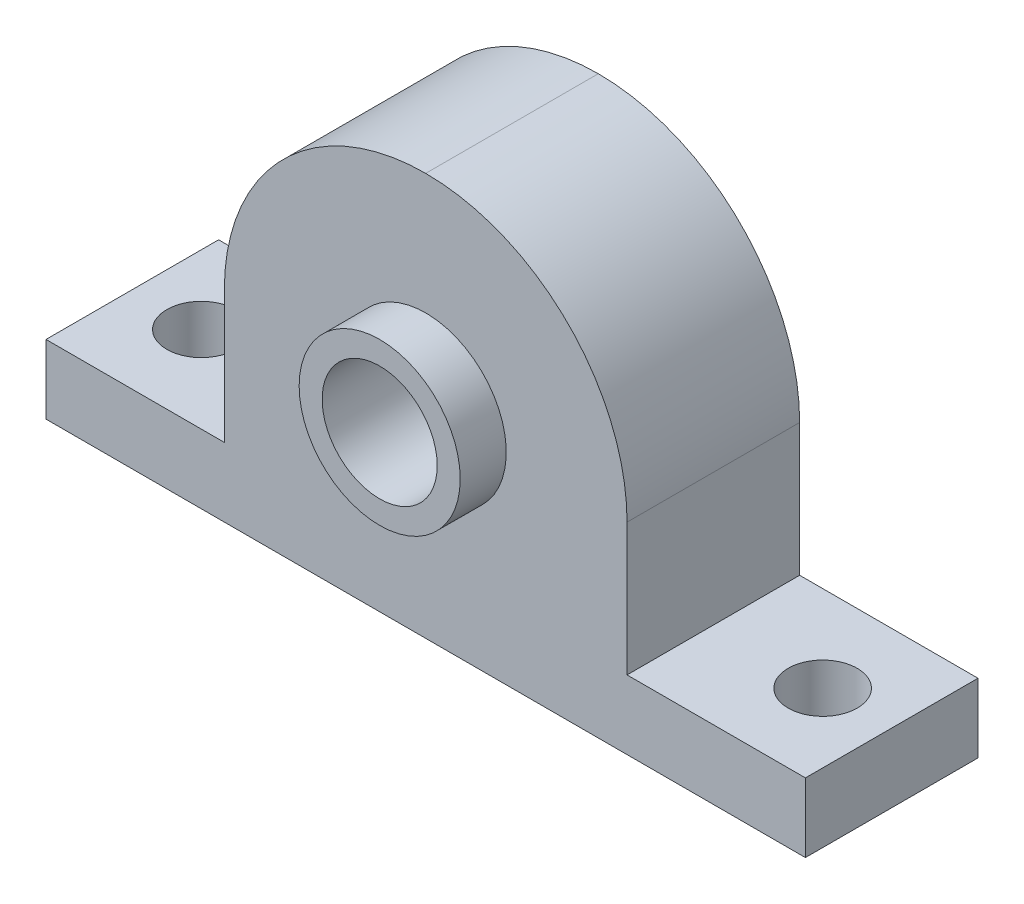
ISO-10303-21;
HEADER;
FILE_DESCRIPTION(('STEP AP214'),'2;1');
FILE_NAME('part.step','',(''),(''),'','','');
FILE_SCHEMA(('AUTOMOTIVE_DESIGN { 1 0 10303 214 1 1 1 1 }'));
ENDSEC;
DATA;
#1=APPLICATION_CONTEXT('core data for automotive mechanical design processes');
#2=APPLICATION_PROTOCOL_DEFINITION('international standard','automotive_design',2000,#1);
#3=PRODUCT_CONTEXT('',#1,'mechanical');
#4=PRODUCT('Part','Part','',(#3));
#5=PRODUCT_RELATED_PRODUCT_CATEGORY('part','',(#4));
#6=PRODUCT_DEFINITION_FORMATION('','',#4);
#7=PRODUCT_DEFINITION_CONTEXT('part definition',#1,'design');
#8=PRODUCT_DEFINITION('design','',#6,#7);
#9=PRODUCT_DEFINITION_SHAPE('','',#8);
#10=(LENGTH_UNIT() NAMED_UNIT(*) SI_UNIT(.MILLI.,.METRE.));
#11=(NAMED_UNIT(*) PLANE_ANGLE_UNIT() SI_UNIT($,.RADIAN.));
#12=(NAMED_UNIT(*) SI_UNIT($,.STERADIAN.) SOLID_ANGLE_UNIT());
#13=UNCERTAINTY_MEASURE_WITH_UNIT(LENGTH_MEASURE(1.E-05),#10,'distance_accuracy_value','');
#14=(GEOMETRIC_REPRESENTATION_CONTEXT(3) GLOBAL_UNCERTAINTY_ASSIGNED_CONTEXT((#13)) GLOBAL_UNIT_ASSIGNED_CONTEXT((#10,
#11,#12)) REPRESENTATION_CONTEXT('',''));
#15=CARTESIAN_POINT('',(0.,0.,0.));
#16=DIRECTION('',(0.,0.,1.));
#17=DIRECTION('',(1.,0.,0.));
#18=AXIS2_PLACEMENT_3D('',#15,#16,#17);
#19=CARTESIAN_POINT('',(0.,6.,0.));
#20=DIRECTION('',(0.,-1.,0.));
#21=DIRECTION('',(0.,0.,-1.));
#22=AXIS2_PLACEMENT_3D('',#19,#20,#21);
#23=PLANE('',#22);
#24=CARTESIAN_POINT('',(27.,6.,0.));
#25=DIRECTION('',(0.,-1.,0.));
#26=DIRECTION('',(0.,0.,1.));
#27=AXIS2_PLACEMENT_3D('',#24,#25,#26);
#28=CIRCLE('',#27,3.);
#29=CARTESIAN_POINT('',(27.,6.,3.));
#30=VERTEX_POINT('',#29);
#31=EDGE_CURVE('E218',#30,#30,#28,.T.);
#32=ORIENTED_EDGE('',*,*,#31,.T.);
#33=EDGE_LOOP('',(#32));
#34=FACE_BOUND('',#33,.T.);
#35=DIRECTION('',(0.,0.,-1.));
#36=VECTOR('',#35,1.);
#37=CARTESIAN_POINT('',(17.5,6.,7.5));
#38=LINE('',#37,#36);
#39=CARTESIAN_POINT('',(17.5,6.,7.5));
#40=VERTEX_POINT('',#39);
#41=CARTESIAN_POINT('',(17.5,6.,-7.5));
#42=VERTEX_POINT('',#41);
#43=EDGE_CURVE('E124',#40,#42,#38,.T.);
#44=ORIENTED_EDGE('',*,*,#43,.F.);
#45=DIRECTION('',(1.,0.,0.));
#46=VECTOR('',#45,1.);
#47=CARTESIAN_POINT('',(-33.,6.,7.5));
#48=LINE('',#47,#46);
#49=CARTESIAN_POINT('',(33.,6.,7.5));
#50=VERTEX_POINT('',#49);
#51=EDGE_CURVE('E120',#40,#50,#48,.T.);
#52=ORIENTED_EDGE('',*,*,#51,.T.);
#53=DIRECTION('',(0.,0.,-1.));
#54=VECTOR('',#53,1.);
#55=CARTESIAN_POINT('',(33.,6.,7.5));
#56=LINE('',#55,#54);
#57=CARTESIAN_POINT('',(33.,6.,-7.5));
#58=VERTEX_POINT('',#57);
#59=EDGE_CURVE('E141',#50,#58,#56,.T.);
#60=ORIENTED_EDGE('',*,*,#59,.T.);
#61=DIRECTION('',(-1.,0.,0.));
#62=VECTOR('',#61,1.);
#63=CARTESIAN_POINT('',(-33.,6.,-7.5));
#64=LINE('',#63,#62);
#65=EDGE_CURVE('E151',#58,#42,#64,.T.);
#66=ORIENTED_EDGE('',*,*,#65,.T.);
#67=EDGE_LOOP('',(#44,#52,#60,#66));
#68=FACE_BOUND('',#67,.T.);
#69=ADVANCED_FACE('F33',(#34,#68),#23,.F.);
#70=CARTESIAN_POINT('',(-27.,6.,0.));
#71=DIRECTION('',(0.,1.,0.));
#72=DIRECTION('',(0.,0.,1.));
#73=AXIS2_PLACEMENT_3D('',#70,#71,#72);
#74=CIRCLE('',#73,3.);
#75=CARTESIAN_POINT('',(-27.,6.,3.));
#76=VERTEX_POINT('',#75);
#77=EDGE_CURVE('E212',#76,#76,#74,.T.);
#78=ORIENTED_EDGE('',*,*,#77,.F.);
#79=EDGE_LOOP('',(#78));
#80=FACE_BOUND('',#79,.T.);
#81=DIRECTION('',(0.,0.,1.));
#82=VECTOR('',#81,1.);
#83=CARTESIAN_POINT('',(-17.5,6.,7.5));
#84=LINE('',#83,#82);
#85=CARTESIAN_POINT('',(-17.5,6.,-7.5));
#86=VERTEX_POINT('',#85);
#87=CARTESIAN_POINT('',(-17.5,6.,7.5));
#88=VERTEX_POINT('',#87);
#89=EDGE_CURVE('E114',#86,#88,#84,.T.);
#90=ORIENTED_EDGE('',*,*,#89,.F.);
#91=CARTESIAN_POINT('',(-33.,6.,-7.5));
#92=VERTEX_POINT('',#91);
#93=EDGE_CURVE('E144',#86,#92,#64,.T.);
#94=ORIENTED_EDGE('',*,*,#93,.T.);
#95=DIRECTION('',(0.,0.,1.));
#96=VECTOR('',#95,1.);
#97=CARTESIAN_POINT('',(-33.,6.,7.5));
#98=LINE('',#97,#96);
#99=CARTESIAN_POINT('',(-33.,6.,7.5));
#100=VERTEX_POINT('',#99);
#101=EDGE_CURVE('E117',#92,#100,#98,.T.);
#102=ORIENTED_EDGE('',*,*,#101,.T.);
#103=EDGE_CURVE('E104',#100,#88,#48,.T.);
#104=ORIENTED_EDGE('',*,*,#103,.T.);
#105=EDGE_LOOP('',(#90,#94,#102,#104));
#106=FACE_BOUND('',#105,.T.);
#107=ADVANCED_FACE('F113',(#80,#106),#23,.F.);
#108=CARTESIAN_POINT('',(33.,6.,7.5));
#109=DIRECTION('',(-1.,0.,0.));
#110=DIRECTION('',(0.,0.,1.));
#111=AXIS2_PLACEMENT_3D('',#108,#109,#110);
#112=PLANE('',#111);
#113=DIRECTION('',(0.,0.,-1.));
#114=VECTOR('',#113,1.);
#115=CARTESIAN_POINT('',(33.,0.,7.5));
#116=LINE('',#115,#114);
#117=CARTESIAN_POINT('',(33.,0.,7.5));
#118=VERTEX_POINT('',#117);
#119=CARTESIAN_POINT('',(33.,0.,-7.5));
#120=VERTEX_POINT('',#119);
#121=EDGE_CURVE('E170',#118,#120,#116,.T.);
#122=ORIENTED_EDGE('',*,*,#121,.T.);
#123=DIRECTION('',(0.,-1.,0.));
#124=VECTOR('',#123,1.);
#125=CARTESIAN_POINT('',(33.,6.,-7.5));
#126=LINE('',#125,#124);
#127=EDGE_CURVE('E154',#58,#120,#126,.T.);
#128=ORIENTED_EDGE('',*,*,#127,.F.);
#129=ORIENTED_EDGE('',*,*,#59,.F.);
#130=DIRECTION('',(0.,-1.,0.));
#131=VECTOR('',#130,1.);
#132=CARTESIAN_POINT('',(33.,6.,7.5));
#133=LINE('',#132,#131);
#134=EDGE_CURVE('E119',#50,#118,#133,.T.);
#135=ORIENTED_EDGE('',*,*,#134,.T.);
#136=EDGE_LOOP('',(#122,#128,#129,#135));
#137=FACE_BOUND('',#136,.T.);
#138=ADVANCED_FACE('F239',(#137),#112,.F.);
#139=CARTESIAN_POINT('',(-33.,6.,-7.5));
#140=DIRECTION('',(0.,0.,1.));
#141=DIRECTION('',(1.,0.,0.));
#142=AXIS2_PLACEMENT_3D('',#139,#140,#141);
#143=PLANE('',#142);
#144=CARTESIAN_POINT('',(0.,17.5,-7.5));
#145=DIRECTION('',(0.,0.,1.));
#146=DIRECTION('',(1.,0.,0.));
#147=AXIS2_PLACEMENT_3D('',#144,#145,#146);
#148=CIRCLE('',#147,5.);
#149=CARTESIAN_POINT('',(5.,17.5,-7.5));
#150=VERTEX_POINT('',#149);
#151=EDGE_CURVE('E202',#150,#150,#148,.T.);
#152=ORIENTED_EDGE('',*,*,#151,.T.);
#153=EDGE_LOOP('',(#152));
#154=FACE_BOUND('',#153,.T.);
#155=CARTESIAN_POINT('',(0.,17.5,-7.5));
#156=DIRECTION('',(0.,0.,1.));
#157=DIRECTION('',(1.,0.,0.));
#158=AXIS2_PLACEMENT_3D('',#155,#156,#157);
#159=CIRCLE('',#158,17.5);
#160=CARTESIAN_POINT('',(-17.5,17.5,-7.5));
#161=VERTEX_POINT('',#160);
#162=CARTESIAN_POINT('',(0.,35.,-7.5));
#163=VERTEX_POINT('',#162);
#164=EDGE_CURVE('E157',#161,#163,#159,.F.);
#165=ORIENTED_EDGE('',*,*,#164,.T.);
#166=CARTESIAN_POINT('',(0.,17.5,-7.5));
#167=DIRECTION('',(0.,0.,1.));
#168=DIRECTION('',(1.,0.,0.));
#169=AXIS2_PLACEMENT_3D('',#166,#167,#168);
#170=CIRCLE('',#169,17.5);
#171=CARTESIAN_POINT('',(17.5,17.5,-7.5));
#172=VERTEX_POINT('',#171);
#173=EDGE_CURVE('E190',#163,#172,#170,.F.);
#174=ORIENTED_EDGE('',*,*,#173,.T.);
#175=DIRECTION('',(0.,-1.,0.));
#176=VECTOR('',#175,1.);
#177=CARTESIAN_POINT('',(17.5,35.,-7.5));
#178=LINE('',#177,#176);
#179=EDGE_CURVE('E172',#172,#42,#178,.T.);
#180=ORIENTED_EDGE('',*,*,#179,.T.);
#181=ORIENTED_EDGE('',*,*,#65,.F.);
#182=ORIENTED_EDGE('',*,*,#127,.T.);
#183=DIRECTION('',(-1.,0.,0.));
#184=VECTOR('',#183,1.);
#185=CARTESIAN_POINT('',(-33.,0.,-7.5));
#186=LINE('',#185,#184);
#187=CARTESIAN_POINT('',(-33.,0.,-7.5));
#188=VERTEX_POINT('',#187);
#189=EDGE_CURVE('E168',#120,#188,#186,.T.);
#190=ORIENTED_EDGE('',*,*,#189,.T.);
#191=DIRECTION('',(0.,-1.,0.));
#192=VECTOR('',#191,1.);
#193=CARTESIAN_POINT('',(-33.,6.,-7.5));
#194=LINE('',#193,#192);
#195=EDGE_CURVE('E158',#92,#188,#194,.T.);
#196=ORIENTED_EDGE('',*,*,#195,.F.);
#197=ORIENTED_EDGE('',*,*,#93,.F.);
#198=DIRECTION('',(0.,-1.,0.));
#199=VECTOR('',#198,1.);
#200=CARTESIAN_POINT('',(-17.5,35.,-7.5));
#201=LINE('',#200,#199);
#202=EDGE_CURVE('E108',#161,#86,#201,.T.);
#203=ORIENTED_EDGE('',*,*,#202,.F.);
#204=EDGE_LOOP('',(#165,#174,#180,#181,#182,#190,#196,#197,#203));
#205=FACE_BOUND('',#204,.T.);
#206=ADVANCED_FACE('F237',(#154,#205),#143,.F.);
#207=CARTESIAN_POINT('',(-33.,6.,7.5));
#208=DIRECTION('',(1.,0.,0.));
#209=DIRECTION('',(0.,0.,-1.));
#210=AXIS2_PLACEMENT_3D('',#207,#208,#209);
#211=PLANE('',#210);
#212=DIRECTION('',(0.,0.,1.));
#213=VECTOR('',#212,1.);
#214=CARTESIAN_POINT('',(-33.,0.,7.5));
#215=LINE('',#214,#213);
#216=CARTESIAN_POINT('',(-33.,0.,7.5));
#217=VERTEX_POINT('',#216);
#218=EDGE_CURVE('E166',#188,#217,#215,.T.);
#219=ORIENTED_EDGE('',*,*,#218,.T.);
#220=DIRECTION('',(0.,-1.,0.));
#221=VECTOR('',#220,1.);
#222=CARTESIAN_POINT('',(-33.,6.,7.5));
#223=LINE('',#222,#221);
#224=EDGE_CURVE('E161',#100,#217,#223,.T.);
#225=ORIENTED_EDGE('',*,*,#224,.F.);
#226=ORIENTED_EDGE('',*,*,#101,.F.);
#227=ORIENTED_EDGE('',*,*,#195,.T.);
#228=EDGE_LOOP('',(#219,#225,#226,#227));
#229=FACE_BOUND('',#228,.T.);
#230=ADVANCED_FACE('F245',(#229),#211,.F.);
#231=CARTESIAN_POINT('',(-33.,6.,7.5));
#232=DIRECTION('',(0.,0.,-1.));
#233=DIRECTION('',(-1.,0.,0.));
#234=AXIS2_PLACEMENT_3D('',#231,#232,#233);
#235=PLANE('',#234);
#236=CARTESIAN_POINT('',(0.,17.5,7.5));
#237=DIRECTION('',(0.,0.,-1.));
#238=DIRECTION('',(-1.,0.,0.));
#239=AXIS2_PLACEMENT_3D('',#236,#237,#238);
#240=CIRCLE('',#239,7.);
#241=CARTESIAN_POINT('',(-7.,17.5,7.5));
#242=VERTEX_POINT('',#241);
#243=EDGE_CURVE('E11',#242,#242,#240,.F.);
#244=ORIENTED_EDGE('',*,*,#243,.F.);
#245=EDGE_LOOP('',(#244));
#246=FACE_BOUND('',#245,.T.);
#247=DIRECTION('',(0.,-1.,0.));
#248=VECTOR('',#247,1.);
#249=CARTESIAN_POINT('',(17.5,35.,7.5));
#250=LINE('',#249,#248);
#251=CARTESIAN_POINT('',(17.5,17.5,7.5));
#252=VERTEX_POINT('',#251);
#253=EDGE_CURVE('E109',#252,#40,#250,.T.);
#254=ORIENTED_EDGE('',*,*,#253,.F.);
#255=CARTESIAN_POINT('',(0.,17.5,7.5));
#256=DIRECTION('',(0.,0.,-1.));
#257=DIRECTION('',(-1.,0.,0.));
#258=AXIS2_PLACEMENT_3D('',#255,#256,#257);
#259=CIRCLE('',#258,17.5);
#260=CARTESIAN_POINT('',(0.,35.,7.5));
#261=VERTEX_POINT('',#260);
#262=EDGE_CURVE('E53',#252,#261,#259,.F.);
#263=ORIENTED_EDGE('',*,*,#262,.T.);
#264=CARTESIAN_POINT('',(0.,17.5,7.5));
#265=DIRECTION('',(0.,0.,-1.));
#266=DIRECTION('',(-1.,0.,0.));
#267=AXIS2_PLACEMENT_3D('',#264,#265,#266);
#268=CIRCLE('',#267,17.5);
#269=CARTESIAN_POINT('',(-17.5,17.5,7.5));
#270=VERTEX_POINT('',#269);
#271=EDGE_CURVE('E48',#261,#270,#268,.F.);
#272=ORIENTED_EDGE('',*,*,#271,.T.);
#273=DIRECTION('',(0.,-1.,0.));
#274=VECTOR('',#273,1.);
#275=CARTESIAN_POINT('',(-17.5,35.,7.5));
#276=LINE('',#275,#274);
#277=EDGE_CURVE('E100',#270,#88,#276,.T.);
#278=ORIENTED_EDGE('',*,*,#277,.T.);
#279=ORIENTED_EDGE('',*,*,#103,.F.);
#280=ORIENTED_EDGE('',*,*,#224,.T.);
#281=DIRECTION('',(1.,0.,0.));
#282=VECTOR('',#281,1.);
#283=CARTESIAN_POINT('',(-33.,0.,7.5));
#284=LINE('',#283,#282);
#285=EDGE_CURVE('E145',#217,#118,#284,.T.);
#286=ORIENTED_EDGE('',*,*,#285,.T.);
#287=ORIENTED_EDGE('',*,*,#134,.F.);
#288=ORIENTED_EDGE('',*,*,#51,.F.);
#289=EDGE_LOOP('',(#254,#263,#272,#278,#279,#280,#286,#287,#288));
#290=FACE_BOUND('',#289,.T.);
#291=ADVANCED_FACE('F102',(#246,#290),#235,.F.);
#292=CARTESIAN_POINT('',(0.,0.,0.));
#293=DIRECTION('',(0.,-1.,0.));
#294=DIRECTION('',(0.,0.,-1.));
#295=AXIS2_PLACEMENT_3D('',#292,#293,#294);
#296=PLANE('',#295);
#297=CARTESIAN_POINT('',(27.,0.,0.));
#298=DIRECTION('',(0.,-1.,0.));
#299=DIRECTION('',(0.,0.,1.));
#300=AXIS2_PLACEMENT_3D('',#297,#298,#299);
#301=CIRCLE('',#300,3.);
#302=CARTESIAN_POINT('',(27.,0.,3.));
#303=VERTEX_POINT('',#302);
#304=EDGE_CURVE('E215',#303,#303,#301,.T.);
#305=ORIENTED_EDGE('',*,*,#304,.F.);
#306=EDGE_LOOP('',(#305));
#307=FACE_BOUND('',#306,.T.);
#308=CARTESIAN_POINT('',(-27.,0.,0.));
#309=DIRECTION('',(0.,1.,0.));
#310=DIRECTION('',(0.,0.,1.));
#311=AXIS2_PLACEMENT_3D('',#308,#309,#310);
#312=CIRCLE('',#311,3.);
#313=CARTESIAN_POINT('',(-27.,0.,3.));
#314=VERTEX_POINT('',#313);
#315=EDGE_CURVE('E211',#314,#314,#312,.T.);
#316=ORIENTED_EDGE('',*,*,#315,.T.);
#317=EDGE_LOOP('',(#316));
#318=FACE_BOUND('',#317,.T.);
#319=ORIENTED_EDGE('',*,*,#121,.F.);
#320=ORIENTED_EDGE('',*,*,#285,.F.);
#321=ORIENTED_EDGE('',*,*,#218,.F.);
#322=ORIENTED_EDGE('',*,*,#189,.F.);
#323=EDGE_LOOP('',(#319,#320,#321,#322));
#324=FACE_BOUND('',#323,.T.);
#325=ADVANCED_FACE('F227',(#307,#318,#324),#296,.T.);
#326=CARTESIAN_POINT('',(17.5,35.,7.5));
#327=DIRECTION('',(-1.,0.,0.));
#328=DIRECTION('',(0.,0.,1.));
#329=AXIS2_PLACEMENT_3D('',#326,#327,#328);
#330=PLANE('',#329);
#331=ORIENTED_EDGE('',*,*,#179,.F.);
#332=DIRECTION('',(0.,0.,-1.));
#333=VECTOR('',#332,1.);
#334=CARTESIAN_POINT('',(17.5,17.5,7.5));
#335=LINE('',#334,#333);
#336=EDGE_CURVE('E191',#172,#252,#335,.F.);
#337=ORIENTED_EDGE('',*,*,#336,.T.);
#338=ORIENTED_EDGE('',*,*,#253,.T.);
#339=ORIENTED_EDGE('',*,*,#43,.T.);
#340=EDGE_LOOP('',(#331,#337,#338,#339));
#341=FACE_BOUND('',#340,.T.);
#342=ADVANCED_FACE('F230',(#341),#330,.F.);
#343=CARTESIAN_POINT('',(-17.5,35.,7.5));
#344=DIRECTION('',(1.,0.,0.));
#345=DIRECTION('',(0.,0.,-1.));
#346=AXIS2_PLACEMENT_3D('',#343,#344,#345);
#347=PLANE('',#346);
#348=ORIENTED_EDGE('',*,*,#277,.F.);
#349=DIRECTION('',(0.,0.,1.));
#350=VECTOR('',#349,1.);
#351=CARTESIAN_POINT('',(-17.5,17.5,7.5));
#352=LINE('',#351,#350);
#353=EDGE_CURVE('E41',#270,#161,#352,.F.);
#354=ORIENTED_EDGE('',*,*,#353,.T.);
#355=ORIENTED_EDGE('',*,*,#202,.T.);
#356=ORIENTED_EDGE('',*,*,#89,.T.);
#357=EDGE_LOOP('',(#348,#354,#355,#356));
#358=FACE_BOUND('',#357,.T.);
#359=ADVANCED_FACE('F122',(#358),#347,.F.);
#360=CARTESIAN_POINT('',(0.,17.5,0.));
#361=DIRECTION('',(0.,0.,1.));
#362=DIRECTION('',(1.,0.,0.));
#363=AXIS2_PLACEMENT_3D('',#360,#361,#362);
#364=CYLINDRICAL_SURFACE('',#363,17.5);
#365=ORIENTED_EDGE('',*,*,#353,.F.);
#366=ORIENTED_EDGE('',*,*,#271,.F.);
#367=DIRECTION('',(0.,0.,1.));
#368=VECTOR('',#367,1.);
#369=CARTESIAN_POINT('',(0.,35.,0.));
#370=LINE('',#369,#368);
#371=EDGE_CURVE('E128',#163,#261,#370,.T.);
#372=ORIENTED_EDGE('',*,*,#371,.F.);
#373=ORIENTED_EDGE('',*,*,#164,.F.);
#374=EDGE_LOOP('',(#365,#366,#372,#373));
#375=FACE_BOUND('',#374,.T.);
#376=ADVANCED_FACE('F35',(#375),#364,.T.);
#377=CARTESIAN_POINT('',(0.,17.5,0.));
#378=DIRECTION('',(0.,0.,-1.));
#379=DIRECTION('',(-1.,0.,0.));
#380=AXIS2_PLACEMENT_3D('',#377,#378,#379);
#381=CYLINDRICAL_SURFACE('',#380,17.5);
#382=ORIENTED_EDGE('',*,*,#262,.F.);
#383=ORIENTED_EDGE('',*,*,#336,.F.);
#384=ORIENTED_EDGE('',*,*,#173,.F.);
#385=ORIENTED_EDGE('',*,*,#371,.T.);
#386=EDGE_LOOP('',(#382,#383,#384,#385));
#387=FACE_BOUND('',#386,.T.);
#388=ADVANCED_FACE('F250',(#387),#381,.T.);
#389=CARTESIAN_POINT('',(0.,17.5,11.5));
#390=DIRECTION('',(0.,0.,-1.));
#391=DIRECTION('',(-1.,0.,0.));
#392=AXIS2_PLACEMENT_3D('',#389,#390,#391);
#393=CYLINDRICAL_SURFACE('',#392,7.);
#394=CARTESIAN_POINT('',(0.,17.5,11.5));
#395=DIRECTION('',(0.,0.,1.));
#396=DIRECTION('',(1.,0.,0.));
#397=AXIS2_PLACEMENT_3D('',#394,#395,#396);
#398=CIRCLE('',#397,7.);
#399=CARTESIAN_POINT('',(7.,17.5,11.5));
#400=VERTEX_POINT('',#399);
#401=EDGE_CURVE('E197',#400,#400,#398,.T.);
#402=ORIENTED_EDGE('',*,*,#401,.F.);
#403=EDGE_LOOP('',(#402));
#404=FACE_BOUND('',#403,.T.);
#405=ORIENTED_EDGE('',*,*,#243,.T.);
#406=EDGE_LOOP('',(#405));
#407=FACE_BOUND('',#406,.T.);
#408=ADVANCED_FACE('F252',(#404,#407),#393,.T.);
#409=CARTESIAN_POINT('',(0.,17.5,11.5));
#410=DIRECTION('',(0.,0.,1.));
#411=DIRECTION('',(1.,0.,0.));
#412=AXIS2_PLACEMENT_3D('',#409,#410,#411);
#413=PLANE('',#412);
#414=CARTESIAN_POINT('',(0.,17.5,11.5));
#415=DIRECTION('',(0.,0.,1.));
#416=DIRECTION('',(1.,0.,0.));
#417=AXIS2_PLACEMENT_3D('',#414,#415,#416);
#418=CIRCLE('',#417,5.);
#419=CARTESIAN_POINT('',(5.,17.5,11.5));
#420=VERTEX_POINT('',#419);
#421=EDGE_CURVE('E206',#420,#420,#418,.T.);
#422=ORIENTED_EDGE('',*,*,#421,.F.);
#423=EDGE_LOOP('',(#422));
#424=FACE_BOUND('',#423,.T.);
#425=ORIENTED_EDGE('',*,*,#401,.T.);
#426=EDGE_LOOP('',(#425));
#427=FACE_BOUND('',#426,.T.);
#428=ADVANCED_FACE('F257',(#424,#427),#413,.T.);
#429=CARTESIAN_POINT('',(0.,17.5,-7.50005));
#430=DIRECTION('',(0.,0.,1.));
#431=DIRECTION('',(1.,0.,0.));
#432=AXIS2_PLACEMENT_3D('',#429,#430,#431);
#433=CYLINDRICAL_SURFACE('',#432,5.);
#434=ORIENTED_EDGE('',*,*,#421,.T.);
#435=EDGE_LOOP('',(#434));
#436=FACE_BOUND('',#435,.T.);
#437=ORIENTED_EDGE('',*,*,#151,.F.);
#438=EDGE_LOOP('',(#437));
#439=FACE_BOUND('',#438,.T.);
#440=ADVANCED_FACE('F333',(#436,#439),#433,.F.);
#441=CARTESIAN_POINT('',(-27.,0.,0.));
#442=DIRECTION('',(0.,1.,0.));
#443=DIRECTION('',(0.,0.,1.));
#444=AXIS2_PLACEMENT_3D('',#441,#442,#443);
#445=CYLINDRICAL_SURFACE('',#444,3.);
#446=ORIENTED_EDGE('',*,*,#315,.F.);
#447=EDGE_LOOP('',(#446));
#448=FACE_BOUND('',#447,.T.);
#449=ORIENTED_EDGE('',*,*,#77,.T.);
#450=EDGE_LOOP('',(#449));
#451=FACE_BOUND('',#450,.T.);
#452=ADVANCED_FACE('F342',(#448,#451),#445,.F.);
#453=CARTESIAN_POINT('',(27.,0.,0.));
#454=DIRECTION('',(0.,1.,0.));
#455=DIRECTION('',(0.,0.,1.));
#456=AXIS2_PLACEMENT_3D('',#453,#454,#455);
#457=CYLINDRICAL_SURFACE('',#456,3.);
#458=ORIENTED_EDGE('',*,*,#304,.T.);
#459=EDGE_LOOP('',(#458));
#460=FACE_BOUND('',#459,.T.);
#461=ORIENTED_EDGE('',*,*,#31,.F.);
#462=EDGE_LOOP('',(#461));
#463=FACE_BOUND('',#462,.T.);
#464=ADVANCED_FACE('F224',(#460,#463),#457,.F.);
#465=CLOSED_SHELL('',(#69,#107,#138,#206,#230,#291,#325,#342,#359,#376,#388,#408,#428,#440,#452,#464));
#466=MANIFOLD_SOLID_BREP('B2',#465);
#467=ADVANCED_BREP_SHAPE_REPRESENTATION('',(#18,#466),#14);
#468=SHAPE_DEFINITION_REPRESENTATION(#9,#467);
ENDSEC;
END-ISO-10303-21;
